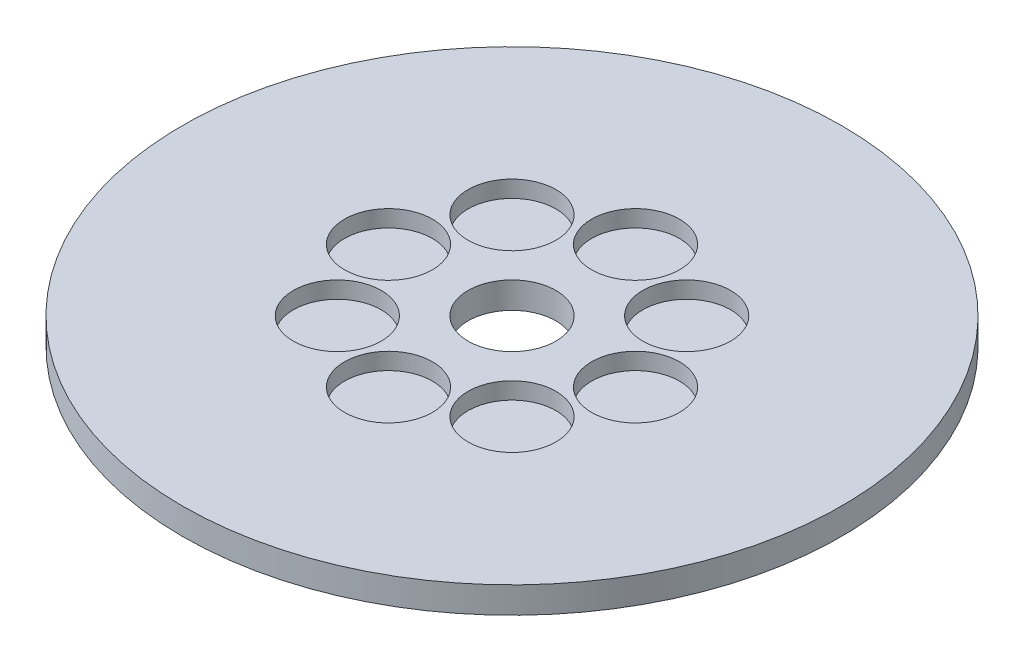
ISO-10303-21;
HEADER;
FILE_DESCRIPTION(('STEP AP214'),'2;1');
FILE_NAME('part.step','',(''),(''),'','','');
FILE_SCHEMA(('AUTOMOTIVE_DESIGN { 1 0 10303 214 1 1 1 1 }'));
ENDSEC;
DATA;
#1=APPLICATION_CONTEXT('core data for automotive mechanical design processes');
#2=APPLICATION_PROTOCOL_DEFINITION('international standard','automotive_design',2000,#1);
#3=PRODUCT_CONTEXT('',#1,'mechanical');
#4=PRODUCT('Part','Part','',(#3));
#5=PRODUCT_RELATED_PRODUCT_CATEGORY('part','',(#4));
#6=PRODUCT_DEFINITION_FORMATION('','',#4);
#7=PRODUCT_DEFINITION_CONTEXT('part definition',#1,'design');
#8=PRODUCT_DEFINITION('design','',#6,#7);
#9=PRODUCT_DEFINITION_SHAPE('','',#8);
#10=(LENGTH_UNIT() NAMED_UNIT(*) SI_UNIT(.MILLI.,.METRE.));
#11=(NAMED_UNIT(*) PLANE_ANGLE_UNIT() SI_UNIT($,.RADIAN.));
#12=(NAMED_UNIT(*) SI_UNIT($,.STERADIAN.) SOLID_ANGLE_UNIT());
#13=UNCERTAINTY_MEASURE_WITH_UNIT(LENGTH_MEASURE(1.E-05),#10,'distance_accuracy_value','');
#14=(GEOMETRIC_REPRESENTATION_CONTEXT(3) GLOBAL_UNCERTAINTY_ASSIGNED_CONTEXT((#13)) GLOBAL_UNIT_ASSIGNED_CONTEXT((#10,
#11,#12)) REPRESENTATION_CONTEXT('',''));
#15=CARTESIAN_POINT('',(0.,0.,0.));
#16=DIRECTION('',(0.,0.,1.));
#17=DIRECTION('',(1.,0.,0.));
#18=AXIS2_PLACEMENT_3D('',#15,#16,#17);
#19=CARTESIAN_POINT('',(0.,6.,0.));
#20=DIRECTION('',(0.,-1.,0.));
#21=DIRECTION('',(0.,0.,-1.));
#22=AXIS2_PLACEMENT_3D('',#19,#20,#21);
#23=CYLINDRICAL_SURFACE('',#22,75.);
#24=CARTESIAN_POINT('',(0.,6.,0.));
#25=DIRECTION('',(0.,1.,0.));
#26=DIRECTION('',(0.,0.,1.));
#27=AXIS2_PLACEMENT_3D('',#24,#25,#26);
#28=CIRCLE('',#27,75.);
#29=CARTESIAN_POINT('',(0.,6.,75.));
#30=VERTEX_POINT('',#29);
#31=EDGE_CURVE('E10',#30,#30,#28,.T.);
#32=ORIENTED_EDGE('',*,*,#31,.F.);
#33=EDGE_LOOP('',(#32));
#34=FACE_BOUND('',#33,.T.);
#35=CARTESIAN_POINT('',(0.,0.,0.));
#36=DIRECTION('',(0.,1.,0.));
#37=DIRECTION('',(0.,0.,1.));
#38=AXIS2_PLACEMENT_3D('',#35,#36,#37);
#39=CIRCLE('',#38,75.);
#40=CARTESIAN_POINT('',(0.,0.,75.));
#41=VERTEX_POINT('',#40);
#42=EDGE_CURVE('E37',#41,#41,#39,.T.);
#43=ORIENTED_EDGE('',*,*,#42,.T.);
#44=EDGE_LOOP('',(#43));
#45=FACE_BOUND('',#44,.T.);
#46=ADVANCED_FACE('F40',(#34,#45),#23,.T.);
#47=CARTESIAN_POINT('',(0.,6.,0.));
#48=DIRECTION('',(0.,1.,0.));
#49=DIRECTION('',(0.,0.,1.));
#50=AXIS2_PLACEMENT_3D('',#47,#48,#49);
#51=PLANE('',#50);
#52=CARTESIAN_POINT('',(28.1118495655929,6.,0.));
#53=DIRECTION('',(0.,1.,0.));
#54=DIRECTION('',(0.,0.,-1.));
#55=AXIS2_PLACEMENT_3D('',#52,#53,#54);
#56=CIRCLE('',#55,10.);
#57=CARTESIAN_POINT('',(28.1118495655929,6.,-10.));
#58=VERTEX_POINT('',#57);
#59=EDGE_CURVE('E78',#58,#58,#56,.T.);
#60=ORIENTED_EDGE('',*,*,#59,.F.);
#61=EDGE_LOOP('',(#60));
#62=FACE_BOUND('',#61,.T.);
#63=CARTESIAN_POINT('',(19.8780794595266,6.,-19.878079459527));
#64=DIRECTION('',(0.,1.,0.));
#65=DIRECTION('',(-0.707106781186554,0.,-0.707106781186541));
#66=AXIS2_PLACEMENT_3D('',#63,#64,#65);
#67=CIRCLE('',#66,10.);
#68=CARTESIAN_POINT('',(12.8070116476611,6.,-26.9491472713924));
#69=VERTEX_POINT('',#68);
#70=EDGE_CURVE('E84',#69,#69,#67,.T.);
#71=ORIENTED_EDGE('',*,*,#70,.F.);
#72=EDGE_LOOP('',(#71));
#73=FACE_BOUND('',#72,.T.);
#74=CARTESIAN_POINT('',(0.,6.,28.1118495655929));
#75=DIRECTION('',(0.,1.,0.));
#76=DIRECTION('',(1.,0.,0.));
#77=AXIS2_PLACEMENT_3D('',#74,#75,#76);
#78=CIRCLE('',#77,10.);
#79=CARTESIAN_POINT('',(10.0000000000001,6.,28.1118495655928));
#80=VERTEX_POINT('',#79);
#81=EDGE_CURVE('E70',#80,#80,#78,.T.);
#82=ORIENTED_EDGE('',*,*,#81,.F.);
#83=EDGE_LOOP('',(#82));
#84=FACE_BOUND('',#83,.T.);
#85=CARTESIAN_POINT('',(19.8780794595269,6.,19.8780794595267));
#86=DIRECTION('',(0.,1.,0.));
#87=DIRECTION('',(0.707106781186544,0.,-0.707106781186551));
#88=AXIS2_PLACEMENT_3D('',#85,#86,#87);
#89=CIRCLE('',#88,10.);
#90=CARTESIAN_POINT('',(26.9491472713923,6.,12.8070116476612));
#91=VERTEX_POINT('',#90);
#92=EDGE_CURVE('E71',#91,#91,#89,.T.);
#93=ORIENTED_EDGE('',*,*,#92,.F.);
#94=EDGE_LOOP('',(#93));
#95=FACE_BOUND('',#94,.T.);
#96=CARTESIAN_POINT('',(-19.878079459527,6.,-19.8780794595266));
#97=DIRECTION('',(0.,1.,0.));
#98=DIRECTION('',(-0.707106781186539,0.,0.707106781186556));
#99=AXIS2_PLACEMENT_3D('',#96,#97,#98);
#100=CIRCLE('',#99,10.);
#101=CARTESIAN_POINT('',(-26.9491472713924,6.,-12.807011647661));
#102=VERTEX_POINT('',#101);
#103=EDGE_CURVE('E100',#102,#102,#100,.T.);
#104=ORIENTED_EDGE('',*,*,#103,.F.);
#105=EDGE_LOOP('',(#104));
#106=FACE_BOUND('',#105,.T.);
#107=CARTESIAN_POINT('',(-2.94455994475899E-13,6.,-28.1118495655929));
#108=DIRECTION('',(0.,1.,0.));
#109=DIRECTION('',(-1.,0.,0.));
#110=AXIS2_PLACEMENT_3D('',#107,#108,#109);
#111=CIRCLE('',#110,10.);
#112=CARTESIAN_POINT('',(-10.0000000000003,6.,-28.1118495655928));
#113=VERTEX_POINT('',#112);
#114=EDGE_CURVE('E93',#113,#113,#111,.T.);
#115=ORIENTED_EDGE('',*,*,#114,.F.);
#116=EDGE_LOOP('',(#115));
#117=FACE_BOUND('',#116,.T.);
#118=CARTESIAN_POINT('',(-19.8780794595268,6.,19.8780794595268));
#119=DIRECTION('',(0.,1.,0.));
#120=DIRECTION('',(0.707106781186549,0.,0.707106781186546));
#121=AXIS2_PLACEMENT_3D('',#118,#119,#120);
#122=CIRCLE('',#121,10.);
#123=CARTESIAN_POINT('',(-12.8070116476613,6.,26.9491472713923));
#124=VERTEX_POINT('',#123);
#125=EDGE_CURVE('E61',#124,#124,#122,.T.);
#126=ORIENTED_EDGE('',*,*,#125,.F.);
#127=EDGE_LOOP('',(#126));
#128=FACE_BOUND('',#127,.T.);
#129=CARTESIAN_POINT('',(-28.1118495655929,6.,0.));
#130=DIRECTION('',(0.,1.,0.));
#131=DIRECTION('',(0.,0.,1.));
#132=AXIS2_PLACEMENT_3D('',#129,#130,#131);
#133=CIRCLE('',#132,10.);
#134=CARTESIAN_POINT('',(-28.1118495655929,6.,10.));
#135=VERTEX_POINT('',#134);
#136=EDGE_CURVE('E54',#135,#135,#133,.T.);
#137=ORIENTED_EDGE('',*,*,#136,.F.);
#138=EDGE_LOOP('',(#137));
#139=FACE_BOUND('',#138,.T.);
#140=CARTESIAN_POINT('',(0.,6.,0.));
#141=DIRECTION('',(0.,1.,0.));
#142=DIRECTION('',(0.,0.,1.));
#143=AXIS2_PLACEMENT_3D('',#140,#141,#142);
#144=CIRCLE('',#143,10.);
#145=CARTESIAN_POINT('',(0.,6.,10.));
#146=VERTEX_POINT('',#145);
#147=EDGE_CURVE('E50',#146,#146,#144,.T.);
#148=ORIENTED_EDGE('',*,*,#147,.F.);
#149=EDGE_LOOP('',(#148));
#150=FACE_BOUND('',#149,.T.);
#151=ORIENTED_EDGE('',*,*,#31,.T.);
#152=EDGE_LOOP('',(#151));
#153=FACE_BOUND('',#152,.T.);
#154=ADVANCED_FACE('F115',(#62,#73,#84,#95,#106,#117,#128,#139,#150,#153),#51,.T.);
#155=CARTESIAN_POINT('',(0.,0.,0.));
#156=DIRECTION('',(0.,1.,0.));
#157=DIRECTION('',(0.,0.,1.));
#158=AXIS2_PLACEMENT_3D('',#155,#156,#157);
#159=PLANE('',#158);
#160=CARTESIAN_POINT('',(0.,0.,0.));
#161=DIRECTION('',(0.,1.,0.));
#162=DIRECTION('',(0.,0.,1.));
#163=AXIS2_PLACEMENT_3D('',#160,#161,#162);
#164=CIRCLE('',#163,10.);
#165=CARTESIAN_POINT('',(0.,0.,10.));
#166=VERTEX_POINT('',#165);
#167=EDGE_CURVE('E47',#166,#166,#164,.T.);
#168=ORIENTED_EDGE('',*,*,#167,.T.);
#169=EDGE_LOOP('',(#168));
#170=FACE_BOUND('',#169,.T.);
#171=ORIENTED_EDGE('',*,*,#42,.F.);
#172=EDGE_LOOP('',(#171));
#173=FACE_BOUND('',#172,.T.);
#174=ADVANCED_FACE('F113',(#170,#173),#159,.F.);
#175=CARTESIAN_POINT('',(0.,6.,0.));
#176=DIRECTION('',(0.,-1.,0.));
#177=DIRECTION('',(0.,0.,-1.));
#178=AXIS2_PLACEMENT_3D('',#175,#176,#177);
#179=CYLINDRICAL_SURFACE('',#178,10.);
#180=ORIENTED_EDGE('',*,*,#147,.T.);
#181=EDGE_LOOP('',(#180));
#182=FACE_BOUND('',#181,.T.);
#183=ORIENTED_EDGE('',*,*,#167,.F.);
#184=EDGE_LOOP('',(#183));
#185=FACE_BOUND('',#184,.T.);
#186=ADVANCED_FACE('F127',(#182,#185),#179,.F.);
#187=CARTESIAN_POINT('',(-28.1118495655929,2.18321257587542,0.));
#188=DIRECTION('',(0.,1.,0.));
#189=DIRECTION('',(0.,0.,1.));
#190=AXIS2_PLACEMENT_3D('',#187,#188,#189);
#191=CYLINDRICAL_SURFACE('',#190,10.);
#192=CARTESIAN_POINT('',(-28.1118495655929,2.18321257587542,0.));
#193=DIRECTION('',(0.,1.,0.));
#194=DIRECTION('',(0.,0.,1.));
#195=AXIS2_PLACEMENT_3D('',#192,#193,#194);
#196=CIRCLE('',#195,10.);
#197=CARTESIAN_POINT('',(-28.1118495655929,2.18321257587542,10.));
#198=VERTEX_POINT('',#197);
#199=EDGE_CURVE('E55',#198,#198,#196,.T.);
#200=ORIENTED_EDGE('',*,*,#199,.F.);
#201=EDGE_LOOP('',(#200));
#202=FACE_BOUND('',#201,.T.);
#203=ORIENTED_EDGE('',*,*,#136,.T.);
#204=EDGE_LOOP('',(#203));
#205=FACE_BOUND('',#204,.T.);
#206=ADVANCED_FACE('F129',(#202,#205),#191,.F.);
#207=CARTESIAN_POINT('',(-28.1118495655929,2.18321257587542,0.));
#208=DIRECTION('',(0.,1.,0.));
#209=DIRECTION('',(0.,0.,1.));
#210=AXIS2_PLACEMENT_3D('',#207,#208,#209);
#211=PLANE('',#210);
#212=ORIENTED_EDGE('',*,*,#199,.T.);
#213=EDGE_LOOP('',(#212));
#214=FACE_BOUND('',#213,.T.);
#215=ADVANCED_FACE('F157',(#214),#211,.T.);
#216=CARTESIAN_POINT('',(-19.8780794595268,2.18321257587542,19.8780794595268));
#217=DIRECTION('',(0.,1.,0.));
#218=DIRECTION('',(0.,0.,1.));
#219=AXIS2_PLACEMENT_3D('',#216,#217,#218);
#220=CYLINDRICAL_SURFACE('',#219,10.);
#221=CARTESIAN_POINT('',(-19.8780794595268,2.18321257587542,19.8780794595268));
#222=DIRECTION('',(0.,1.,0.));
#223=DIRECTION('',(0.707106781186549,0.,0.707106781186546));
#224=AXIS2_PLACEMENT_3D('',#221,#222,#223);
#225=CIRCLE('',#224,10.);
#226=CARTESIAN_POINT('',(-12.8070116476613,2.18321257587542,26.9491472713923));
#227=VERTEX_POINT('',#226);
#228=EDGE_CURVE('E59',#227,#227,#225,.T.);
#229=ORIENTED_EDGE('',*,*,#228,.F.);
#230=EDGE_LOOP('',(#229));
#231=FACE_BOUND('',#230,.T.);
#232=ORIENTED_EDGE('',*,*,#125,.T.);
#233=EDGE_LOOP('',(#232));
#234=FACE_BOUND('',#233,.T.);
#235=ADVANCED_FACE('F170',(#231,#234),#220,.F.);
#236=CARTESIAN_POINT('',(-19.8780794595268,2.18321257587542,19.8780794595268));
#237=DIRECTION('',(0.,1.,0.));
#238=DIRECTION('',(0.707106781186549,0.,0.707106781186546));
#239=AXIS2_PLACEMENT_3D('',#236,#237,#238);
#240=PLANE('',#239);
#241=ORIENTED_EDGE('',*,*,#228,.T.);
#242=EDGE_LOOP('',(#241));
#243=FACE_BOUND('',#242,.T.);
#244=ADVANCED_FACE('F182',(#243),#240,.T.);
#245=CARTESIAN_POINT('',(-2.94455994475899E-13,2.18321257587542,-28.1118495655929));
#246=DIRECTION('',(0.,1.,0.));
#247=DIRECTION('',(0.,0.,1.));
#248=AXIS2_PLACEMENT_3D('',#245,#246,#247);
#249=CYLINDRICAL_SURFACE('',#248,10.);
#250=CARTESIAN_POINT('',(-2.94455994475899E-13,2.18321257587542,-28.1118495655929));
#251=DIRECTION('',(0.,1.,0.));
#252=DIRECTION('',(-1.,0.,0.));
#253=AXIS2_PLACEMENT_3D('',#250,#251,#252);
#254=CIRCLE('',#253,10.);
#255=CARTESIAN_POINT('',(-10.0000000000003,2.18321257587542,-28.1118495655928));
#256=VERTEX_POINT('',#255);
#257=EDGE_CURVE('E86',#256,#256,#254,.T.);
#258=ORIENTED_EDGE('',*,*,#257,.F.);
#259=EDGE_LOOP('',(#258));
#260=FACE_BOUND('',#259,.T.);
#261=ORIENTED_EDGE('',*,*,#114,.T.);
#262=EDGE_LOOP('',(#261));
#263=FACE_BOUND('',#262,.T.);
#264=ADVANCED_FACE('F189',(#260,#263),#249,.F.);
#265=CARTESIAN_POINT('',(-2.94455994475899E-13,2.18321257587542,-28.1118495655929));
#266=DIRECTION('',(0.,1.,0.));
#267=DIRECTION('',(-1.,0.,0.));
#268=AXIS2_PLACEMENT_3D('',#265,#266,#267);
#269=PLANE('',#268);
#270=ORIENTED_EDGE('',*,*,#257,.T.);
#271=EDGE_LOOP('',(#270));
#272=FACE_BOUND('',#271,.T.);
#273=ADVANCED_FACE('F107',(#272),#269,.T.);
#274=CARTESIAN_POINT('',(-19.878079459527,2.18321257587542,-19.8780794595266));
#275=DIRECTION('',(0.,1.,0.));
#276=DIRECTION('',(0.,0.,1.));
#277=AXIS2_PLACEMENT_3D('',#274,#275,#276);
#278=CYLINDRICAL_SURFACE('',#277,10.);
#279=CARTESIAN_POINT('',(-19.878079459527,2.18321257587542,-19.8780794595266));
#280=DIRECTION('',(0.,1.,0.));
#281=DIRECTION('',(-0.707106781186539,0.,0.707106781186556));
#282=AXIS2_PLACEMENT_3D('',#279,#280,#281);
#283=CIRCLE('',#282,10.);
#284=CARTESIAN_POINT('',(-26.9491472713924,2.18321257587542,-12.807011647661));
#285=VERTEX_POINT('',#284);
#286=EDGE_CURVE('E94',#285,#285,#283,.T.);
#287=ORIENTED_EDGE('',*,*,#286,.F.);
#288=EDGE_LOOP('',(#287));
#289=FACE_BOUND('',#288,.T.);
#290=ORIENTED_EDGE('',*,*,#103,.T.);
#291=EDGE_LOOP('',(#290));
#292=FACE_BOUND('',#291,.T.);
#293=ADVANCED_FACE('F104',(#289,#292),#278,.F.);
#294=CARTESIAN_POINT('',(-19.878079459527,2.18321257587542,-19.8780794595266));
#295=DIRECTION('',(0.,1.,0.));
#296=DIRECTION('',(-0.707106781186539,0.,0.707106781186556));
#297=AXIS2_PLACEMENT_3D('',#294,#295,#296);
#298=PLANE('',#297);
#299=ORIENTED_EDGE('',*,*,#286,.T.);
#300=EDGE_LOOP('',(#299));
#301=FACE_BOUND('',#300,.T.);
#302=ADVANCED_FACE('F103',(#301),#298,.T.);
#303=CARTESIAN_POINT('',(19.8780794595269,2.18321257587542,19.8780794595267));
#304=DIRECTION('',(0.,1.,0.));
#305=DIRECTION('',(0.,0.,1.));
#306=AXIS2_PLACEMENT_3D('',#303,#304,#305);
#307=CYLINDRICAL_SURFACE('',#306,10.);
#308=CARTESIAN_POINT('',(19.8780794595269,2.18321257587542,19.8780794595267));
#309=DIRECTION('',(0.,1.,0.));
#310=DIRECTION('',(0.707106781186544,0.,-0.707106781186551));
#311=AXIS2_PLACEMENT_3D('',#308,#309,#310);
#312=CIRCLE('',#311,10.);
#313=CARTESIAN_POINT('',(26.9491472713923,2.18321257587542,12.8070116476612));
#314=VERTEX_POINT('',#313);
#315=EDGE_CURVE('E69',#314,#314,#312,.T.);
#316=ORIENTED_EDGE('',*,*,#315,.F.);
#317=EDGE_LOOP('',(#316));
#318=FACE_BOUND('',#317,.T.);
#319=ORIENTED_EDGE('',*,*,#92,.T.);
#320=EDGE_LOOP('',(#319));
#321=FACE_BOUND('',#320,.T.);
#322=ADVANCED_FACE('F219',(#318,#321),#307,.F.);
#323=CARTESIAN_POINT('',(19.8780794595269,2.18321257587542,19.8780794595267));
#324=DIRECTION('',(0.,1.,0.));
#325=DIRECTION('',(0.707106781186544,0.,-0.707106781186551));
#326=AXIS2_PLACEMENT_3D('',#323,#324,#325);
#327=PLANE('',#326);
#328=ORIENTED_EDGE('',*,*,#315,.T.);
#329=EDGE_LOOP('',(#328));
#330=FACE_BOUND('',#329,.T.);
#331=ADVANCED_FACE('F227',(#330),#327,.T.);
#332=CARTESIAN_POINT('',(0.,2.18321257587542,28.1118495655929));
#333=DIRECTION('',(0.,1.,0.));
#334=DIRECTION('',(0.,0.,1.));
#335=AXIS2_PLACEMENT_3D('',#332,#333,#334);
#336=CYLINDRICAL_SURFACE('',#335,10.);
#337=CARTESIAN_POINT('',(0.,2.18321257587542,28.1118495655929));
#338=DIRECTION('',(0.,1.,0.));
#339=DIRECTION('',(1.,0.,0.));
#340=AXIS2_PLACEMENT_3D('',#337,#338,#339);
#341=CIRCLE('',#340,10.);
#342=CARTESIAN_POINT('',(10.0000000000001,2.18321257587542,28.1118495655928));
#343=VERTEX_POINT('',#342);
#344=EDGE_CURVE('E63',#343,#343,#341,.T.);
#345=ORIENTED_EDGE('',*,*,#344,.F.);
#346=EDGE_LOOP('',(#345));
#347=FACE_BOUND('',#346,.T.);
#348=ORIENTED_EDGE('',*,*,#81,.T.);
#349=EDGE_LOOP('',(#348));
#350=FACE_BOUND('',#349,.T.);
#351=ADVANCED_FACE('F240',(#347,#350),#336,.F.);
#352=CARTESIAN_POINT('',(0.,2.18321257587542,28.1118495655929));
#353=DIRECTION('',(0.,1.,0.));
#354=DIRECTION('',(1.,0.,0.));
#355=AXIS2_PLACEMENT_3D('',#352,#353,#354);
#356=PLANE('',#355);
#357=ORIENTED_EDGE('',*,*,#344,.T.);
#358=EDGE_LOOP('',(#357));
#359=FACE_BOUND('',#358,.T.);
#360=ADVANCED_FACE('F246',(#359),#356,.T.);
#361=CARTESIAN_POINT('',(19.8780794595266,2.18321257587542,-19.878079459527));
#362=DIRECTION('',(0.,1.,0.));
#363=DIRECTION('',(0.,0.,1.));
#364=AXIS2_PLACEMENT_3D('',#361,#362,#363);
#365=CYLINDRICAL_SURFACE('',#364,10.);
#366=CARTESIAN_POINT('',(19.8780794595266,2.18321257587542,-19.878079459527));
#367=DIRECTION('',(0.,1.,0.));
#368=DIRECTION('',(-0.707106781186554,0.,-0.707106781186541));
#369=AXIS2_PLACEMENT_3D('',#366,#367,#368);
#370=CIRCLE('',#369,10.);
#371=CARTESIAN_POINT('',(12.8070116476611,2.18321257587542,-26.9491472713924));
#372=VERTEX_POINT('',#371);
#373=EDGE_CURVE('E85',#372,#372,#370,.T.);
#374=ORIENTED_EDGE('',*,*,#373,.F.);
#375=EDGE_LOOP('',(#374));
#376=FACE_BOUND('',#375,.T.);
#377=ORIENTED_EDGE('',*,*,#70,.T.);
#378=EDGE_LOOP('',(#377));
#379=FACE_BOUND('',#378,.T.);
#380=ADVANCED_FACE('F254',(#376,#379),#365,.F.);
#381=CARTESIAN_POINT('',(19.8780794595266,2.18321257587542,-19.878079459527));
#382=DIRECTION('',(0.,1.,0.));
#383=DIRECTION('',(-0.707106781186554,0.,-0.707106781186541));
#384=AXIS2_PLACEMENT_3D('',#381,#382,#383);
#385=PLANE('',#384);
#386=ORIENTED_EDGE('',*,*,#373,.T.);
#387=EDGE_LOOP('',(#386));
#388=FACE_BOUND('',#387,.T.);
#389=ADVANCED_FACE('F262',(#388),#385,.T.);
#390=CARTESIAN_POINT('',(28.1118495655929,2.18321257587542,0.));
#391=DIRECTION('',(0.,1.,0.));
#392=DIRECTION('',(0.,0.,1.));
#393=AXIS2_PLACEMENT_3D('',#390,#391,#392);
#394=CYLINDRICAL_SURFACE('',#393,10.);
#395=CARTESIAN_POINT('',(28.1118495655929,2.18321257587542,0.));
#396=DIRECTION('',(0.,1.,0.));
#397=DIRECTION('',(0.,0.,-1.));
#398=AXIS2_PLACEMENT_3D('',#395,#396,#397);
#399=CIRCLE('',#398,10.);
#400=CARTESIAN_POINT('',(28.1118495655929,2.18321257587542,-10.));
#401=VERTEX_POINT('',#400);
#402=EDGE_CURVE('E76',#401,#401,#399,.T.);
#403=ORIENTED_EDGE('',*,*,#402,.F.);
#404=EDGE_LOOP('',(#403));
#405=FACE_BOUND('',#404,.T.);
#406=ORIENTED_EDGE('',*,*,#59,.T.);
#407=EDGE_LOOP('',(#406));
#408=FACE_BOUND('',#407,.T.);
#409=ADVANCED_FACE('F272',(#405,#408),#394,.F.);
#410=CARTESIAN_POINT('',(28.1118495655929,2.18321257587542,0.));
#411=DIRECTION('',(0.,1.,0.));
#412=DIRECTION('',(0.,0.,-1.));
#413=AXIS2_PLACEMENT_3D('',#410,#411,#412);
#414=PLANE('',#413);
#415=ORIENTED_EDGE('',*,*,#402,.T.);
#416=EDGE_LOOP('',(#415));
#417=FACE_BOUND('',#416,.T.);
#418=ADVANCED_FACE('F285',(#417),#414,.T.);
#419=CLOSED_SHELL('',(#46,#154,#174,#186,#206,#215,#235,#244,#264,#273,#293,#302,#322,#331,#351,
#360,#380,#389,#409,#418));
#420=MANIFOLD_SOLID_BREP('B2',#419);
#421=ADVANCED_BREP_SHAPE_REPRESENTATION('',(#18,#420),#14);
#422=SHAPE_DEFINITION_REPRESENTATION(#9,#421);
ENDSEC;
END-ISO-10303-21;
